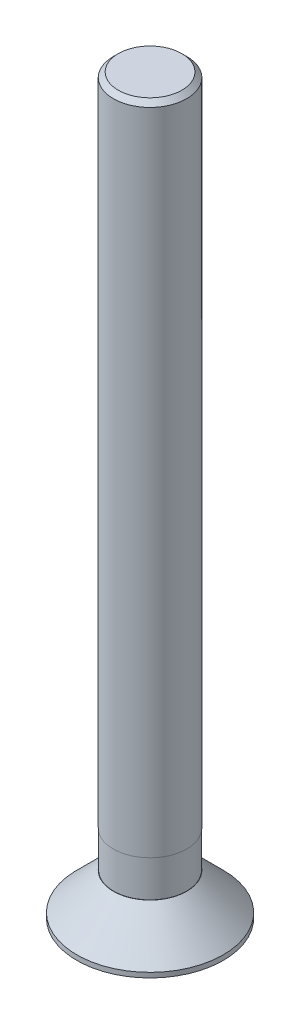
ISO-10303-21;
HEADER;
FILE_DESCRIPTION(('STEP AP214'),'2;1');
FILE_NAME('part.step','',(''),(''),'','','');
FILE_SCHEMA(('AUTOMOTIVE_DESIGN { 1 0 10303 214 1 1 1 1 }'));
ENDSEC;
DATA;
#1=APPLICATION_CONTEXT('core data for automotive mechanical design processes');
#2=APPLICATION_PROTOCOL_DEFINITION('international standard','automotive_design',2000,#1);
#3=PRODUCT_CONTEXT('',#1,'mechanical');
#4=PRODUCT('Part','Part','',(#3));
#5=PRODUCT_RELATED_PRODUCT_CATEGORY('part','',(#4));
#6=PRODUCT_DEFINITION_FORMATION('','',#4);
#7=PRODUCT_DEFINITION_CONTEXT('part definition',#1,'design');
#8=PRODUCT_DEFINITION('design','',#6,#7);
#9=PRODUCT_DEFINITION_SHAPE('','',#8);
#10=(LENGTH_UNIT() NAMED_UNIT(*) SI_UNIT(.MILLI.,.METRE.));
#11=(NAMED_UNIT(*) PLANE_ANGLE_UNIT() SI_UNIT($,.RADIAN.));
#12=(NAMED_UNIT(*) SI_UNIT($,.STERADIAN.) SOLID_ANGLE_UNIT());
#13=UNCERTAINTY_MEASURE_WITH_UNIT(LENGTH_MEASURE(1.E-05),#10,'distance_accuracy_value','');
#14=(GEOMETRIC_REPRESENTATION_CONTEXT(3) GLOBAL_UNCERTAINTY_ASSIGNED_CONTEXT((#13)) GLOBAL_UNIT_ASSIGNED_CONTEXT((#10,
#11,#12)) REPRESENTATION_CONTEXT('',''));
#15=CARTESIAN_POINT('',(0.,0.,0.));
#16=DIRECTION('',(0.,0.,1.));
#17=DIRECTION('',(1.,0.,0.));
#18=AXIS2_PLACEMENT_3D('',#15,#16,#17);
#19=CARTESIAN_POINT('',(0.,-1.87388386780294,0.));
#20=DIRECTION('',(0.,1.,0.));
#21=DIRECTION('',(0.,0.,1.));
#22=AXIS2_PLACEMENT_3D('',#19,#20,#21);
#23=PLANE('',#22);
#24=CARTESIAN_POINT('',(0.,-1.87388386780294,0.));
#25=DIRECTION('',(0.,-1.,0.));
#26=DIRECTION('',(0.,0.,-1.));
#27=AXIS2_PLACEMENT_3D('',#24,#25,#26);
#28=CIRCLE('',#27,1.15470053837925);
#29=CARTESIAN_POINT('',(0.577350269189622,-1.87388386780294,1.));
#30=VERTEX_POINT('',#29);
#31=CARTESIAN_POINT('',(-0.577351404949256,-1.87388386780294,1.00000196587773));
#32=VERTEX_POINT('',#31);
#33=EDGE_CURVE('E169',#30,#32,#28,.T.);
#34=ORIENTED_EDGE('',*,*,#33,.F.);
#35=CARTESIAN_POINT('',(1.15470053837925,-1.87388386780294,0.));
#36=VERTEX_POINT('',#35);
#37=EDGE_CURVE('E48',#36,#30,#28,.T.);
#38=ORIENTED_EDGE('',*,*,#37,.F.);
#39=CARTESIAN_POINT('',(0.577351404949261,-1.87388386780294,-1.00000196587773));
#40=VERTEX_POINT('',#39);
#41=EDGE_CURVE('E165',#40,#36,#28,.T.);
#42=ORIENTED_EDGE('',*,*,#41,.F.);
#43=CARTESIAN_POINT('',(-0.577349400992379,-1.87388386780294,-0.999998495164493));
#44=VERTEX_POINT('',#43);
#45=EDGE_CURVE('E63',#44,#40,#28,.T.);
#46=ORIENTED_EDGE('',*,*,#45,.F.);
#47=CARTESIAN_POINT('',(-1.15470053837925,-1.87388386780294,0.));
#48=VERTEX_POINT('',#47);
#49=EDGE_CURVE('E72',#48,#44,#28,.T.);
#50=ORIENTED_EDGE('',*,*,#49,.F.);
#51=EDGE_CURVE('E252',#32,#48,#28,.T.);
#52=ORIENTED_EDGE('',*,*,#51,.F.);
#53=EDGE_LOOP('',(#34,#38,#42,#46,#50,#52));
#54=FACE_BOUND('',#53,.T.);
#55=CARTESIAN_POINT('',(0.,-1.87388386780294,0.));
#56=DIRECTION('',(0.,-1.,0.));
#57=DIRECTION('',(0.,0.,-1.));
#58=AXIS2_PLACEMENT_3D('',#55,#56,#57);
#59=CIRCLE('',#58,3.);
#60=CARTESIAN_POINT('',(0.,-1.87388386780294,-3.));
#61=VERTEX_POINT('',#60);
#62=EDGE_CURVE('E488',#61,#61,#59,.T.);
#63=ORIENTED_EDGE('',*,*,#62,.T.);
#64=EDGE_LOOP('',(#63));
#65=FACE_BOUND('',#64,.T.);
#66=ADVANCED_FACE('F43',(#54,#65),#23,.F.);
#67=CARTESIAN_POINT('',(0.,0.,0.));
#68=DIRECTION('',(0.,-1.,0.));
#69=DIRECTION('',(0.,0.,-1.));
#70=AXIS2_PLACEMENT_3D('',#67,#68,#69);
#71=CYLINDRICAL_SURFACE('',#70,3.);
#72=ORIENTED_EDGE('',*,*,#62,.F.);
#73=EDGE_LOOP('',(#72));
#74=FACE_BOUND('',#73,.T.);
#75=CARTESIAN_POINT('',(0.,-1.67388386780294,0.));
#76=DIRECTION('',(0.,-1.,0.));
#77=DIRECTION('',(0.,0.,-1.));
#78=AXIS2_PLACEMENT_3D('',#75,#76,#77);
#79=CIRCLE('',#78,3.);
#80=CARTESIAN_POINT('',(0.,-1.67388386780294,-3.));
#81=VERTEX_POINT('',#80);
#82=EDGE_CURVE('E484',#81,#81,#79,.T.);
#83=ORIENTED_EDGE('',*,*,#82,.T.);
#84=EDGE_LOOP('',(#83));
#85=FACE_BOUND('',#84,.T.);
#86=ADVANCED_FACE('F190',(#74,#85),#71,.T.);
#87=CARTESIAN_POINT('',(0.,-0.173883867802944,0.));
#88=DIRECTION('',(0.,-1.,0.));
#89=DIRECTION('',(0.,0.,-1.));
#90=AXIS2_PLACEMENT_3D('',#87,#88,#89);
#91=CONICAL_SURFACE('',#90,1.5,0.785398163397447);
#92=ORIENTED_EDGE('',*,*,#82,.F.);
#93=EDGE_LOOP('',(#92));
#94=FACE_BOUND('',#93,.T.);
#95=CARTESIAN_POINT('',(0.,-0.173883867802944,0.));
#96=DIRECTION('',(0.,-1.,0.));
#97=DIRECTION('',(0.,0.,-1.));
#98=AXIS2_PLACEMENT_3D('',#95,#96,#97);
#99=CIRCLE('',#98,1.5);
#100=CARTESIAN_POINT('',(0.,-0.173883867802944,-1.5));
#101=VERTEX_POINT('',#100);
#102=EDGE_CURVE('E480',#101,#101,#99,.T.);
#103=ORIENTED_EDGE('',*,*,#102,.T.);
#104=EDGE_LOOP('',(#103));
#105=FACE_BOUND('',#104,.T.);
#106=ADVANCED_FACE('F527',(#94,#105),#91,.T.);
#107=CARTESIAN_POINT('',(-1.5,-0.173883867802944,0.));
#108=DIRECTION('',(0.,-1.,0.));
#109=DIRECTION('',(0.,0.,-1.));
#110=AXIS2_PLACEMENT_3D('',#107,#108,#109);
#111=PLANE('',#110);
#112=ORIENTED_EDGE('',*,*,#102,.F.);
#113=EDGE_LOOP('',(#112));
#114=FACE_BOUND('',#113,.T.);
#115=CARTESIAN_POINT('',(0.,-0.173883867802944,0.));
#116=DIRECTION('',(0.,-1.,0.));
#117=DIRECTION('',(0.,0.,-1.));
#118=AXIS2_PLACEMENT_3D('',#115,#116,#117);
#119=CIRCLE('',#118,1.49000000000001);
#120=CARTESIAN_POINT('',(0.,-0.173883867802944,-1.49000000000001));
#121=VERTEX_POINT('',#120);
#122=EDGE_CURVE('E476',#121,#121,#119,.T.);
#123=ORIENTED_EDGE('',*,*,#122,.T.);
#124=EDGE_LOOP('',(#123));
#125=FACE_BOUND('',#124,.T.);
#126=ADVANCED_FACE('F520',(#114,#125),#111,.F.);
#127=CARTESIAN_POINT('',(0.,0.,0.));
#128=DIRECTION('',(0.,-1.,0.));
#129=DIRECTION('',(0.,0.,-1.));
#130=AXIS2_PLACEMENT_3D('',#127,#128,#129);
#131=CYLINDRICAL_SURFACE('',#130,1.49000000000001);
#132=ORIENTED_EDGE('',*,*,#122,.F.);
#133=EDGE_LOOP('',(#132));
#134=FACE_BOUND('',#133,.T.);
#135=CARTESIAN_POINT('',(0.,1.32611613219706,0.));
#136=DIRECTION('',(0.,-1.,0.));
#137=DIRECTION('',(0.,0.,-1.));
#138=AXIS2_PLACEMENT_3D('',#135,#136,#137);
#139=CIRCLE('',#138,1.49000000000001);
#140=CARTESIAN_POINT('',(0.,1.32611613219706,-1.49000000000001));
#141=VERTEX_POINT('',#140);
#142=EDGE_CURVE('E235',#141,#141,#139,.T.);
#143=ORIENTED_EDGE('',*,*,#142,.T.);
#144=EDGE_LOOP('',(#143));
#145=FACE_BOUND('',#144,.T.);
#146=ADVANCED_FACE('F514',(#134,#145),#131,.T.);
#147=CARTESIAN_POINT('',(-1.5,1.32611613219706,0.));
#148=DIRECTION('',(0.,1.,0.));
#149=DIRECTION('',(0.,0.,1.));
#150=AXIS2_PLACEMENT_3D('',#147,#148,#149);
#151=PLANE('',#150);
#152=ORIENTED_EDGE('',*,*,#142,.F.);
#153=EDGE_LOOP('',(#152));
#154=FACE_BOUND('',#153,.T.);
#155=CARTESIAN_POINT('',(0.,1.32611613219706,0.));
#156=DIRECTION('',(0.,-1.,0.));
#157=DIRECTION('',(0.,0.,-1.));
#158=AXIS2_PLACEMENT_3D('',#155,#156,#157);
#159=CIRCLE('',#158,1.5);
#160=CARTESIAN_POINT('',(0.,1.32611613219706,-1.5));
#161=VERTEX_POINT('',#160);
#162=EDGE_CURVE('E229',#161,#161,#159,.T.);
#163=ORIENTED_EDGE('',*,*,#162,.T.);
#164=EDGE_LOOP('',(#163));
#165=FACE_BOUND('',#164,.T.);
#166=ADVANCED_FACE('F509',(#154,#165),#151,.F.);
#167=CARTESIAN_POINT('',(0.,0.,0.));
#168=DIRECTION('',(0.,-1.,0.));
#169=DIRECTION('',(0.,0.,-1.));
#170=AXIS2_PLACEMENT_3D('',#167,#168,#169);
#171=CYLINDRICAL_SURFACE('',#170,1.5);
#172=CARTESIAN_POINT('',(0.,27.9261161321971,0.));
#173=DIRECTION('',(0.,-1.,0.));
#174=DIRECTION('',(0.,0.,-1.));
#175=AXIS2_PLACEMENT_3D('',#172,#173,#174);
#176=CIRCLE('',#175,1.5);
#177=CARTESIAN_POINT('',(0.,27.9261161321971,-1.5));
#178=VERTEX_POINT('',#177);
#179=EDGE_CURVE('E492',#178,#178,#176,.T.);
#180=ORIENTED_EDGE('',*,*,#179,.T.);
#181=EDGE_LOOP('',(#180));
#182=FACE_BOUND('',#181,.T.);
#183=ORIENTED_EDGE('',*,*,#162,.F.);
#184=EDGE_LOOP('',(#183));
#185=FACE_BOUND('',#184,.T.);
#186=ADVANCED_FACE('F506',(#182,#185),#171,.T.);
#187=CARTESIAN_POINT('',(-1.5,28.1261161321971,0.));
#188=DIRECTION('',(0.,-1.,0.));
#189=DIRECTION('',(0.,0.,-1.));
#190=AXIS2_PLACEMENT_3D('',#187,#188,#189);
#191=PLANE('',#190);
#192=CARTESIAN_POINT('',(0.,28.1261161321971,0.));
#193=DIRECTION('',(0.,-1.,0.));
#194=DIRECTION('',(0.,0.,-1.));
#195=AXIS2_PLACEMENT_3D('',#192,#193,#194);
#196=CIRCLE('',#195,1.3);
#197=CARTESIAN_POINT('',(0.,28.1261161321971,-1.3));
#198=VERTEX_POINT('',#197);
#199=EDGE_CURVE('E143',#198,#198,#196,.F.);
#200=ORIENTED_EDGE('',*,*,#199,.T.);
#201=EDGE_LOOP('',(#200));
#202=FACE_BOUND('',#201,.T.);
#203=ADVANCED_FACE('F500',(#202),#191,.F.);
#204=CARTESIAN_POINT('',(0.,27.9261161321971,0.));
#205=DIRECTION('',(0.,-1.,0.));
#206=DIRECTION('',(0.,0.,-1.));
#207=AXIS2_PLACEMENT_3D('',#204,#205,#206);
#208=CONICAL_SURFACE('',#207,1.5,0.785398163397445);
#209=ORIENTED_EDGE('',*,*,#199,.F.);
#210=EDGE_LOOP('',(#209));
#211=FACE_BOUND('',#210,.T.);
#212=ORIENTED_EDGE('',*,*,#179,.F.);
#213=EDGE_LOOP('',(#212));
#214=FACE_BOUND('',#213,.T.);
#215=ADVANCED_FACE('F46',(#211,#214),#208,.T.);
#216=CARTESIAN_POINT('',(0.,-1.67388386780294,0.));
#217=DIRECTION('',(0.,-1.,0.));
#218=DIRECTION('',(0.,0.,-1.));
#219=AXIS2_PLACEMENT_3D('',#216,#217,#218);
#220=CONICAL_SURFACE('',#219,1.,0.658373937780637);
#221=ORIENTED_EDGE('',*,*,#37,.T.);
#222=CARTESIAN_POINT('',(1.15481600843309,-1.87403317222531,-0.000200000000004098));
#223=CARTESIAN_POINT('',(1.12316968084601,-1.83312074343118,0.0546130472537906));
#224=CARTESIAN_POINT('',(1.08981777101109,-1.7949634354735,0.112380249617313));
#225=CARTESIAN_POINT('',(1.01992640588559,-1.73108200853424,0.23343564502504));
#226=CARTESIAN_POINT('',(0.983356831795588,-1.70549438660236,0.296776005360072));
#227=CARTESIAN_POINT('',(0.922834286723981,-1.68090454364989,0.401604128427474));
#228=CARTESIAN_POINT('',(0.899599220479203,-1.67539508616111,0.441848443680657));
#229=CARTESIAN_POINT('',(0.853188056508933,-1.67292846256111,0.522234937715575));
#230=CARTESIAN_POINT('',(0.830012776254828,-1.67590886460221,0.562375700595333));
#231=CARTESIAN_POINT('',(0.7843927818388,-1.68969055585273,0.641391848764902));
#232=CARTESIAN_POINT('',(0.761945122594874,-1.70045466265438,0.680272335086375));
#233=CARTESIAN_POINT('',(0.717921697470909,-1.72826497434569,0.756523144124287));
#234=CARTESIAN_POINT('',(0.696352541805856,-1.74535152902818,0.793882017612521));
#235=CARTESIAN_POINT('',(0.658212463672071,-1.78048875912147,0.859942570744883));
#236=CARTESIAN_POINT('',(0.641457966963329,-1.79776924631449,0.888962210299669));
#237=CARTESIAN_POINT('',(0.608790299876737,-1.83445807832726,0.945544269458392));
#238=CARTESIAN_POINT('',(0.592869676372208,-1.85383970255314,0.973119598256412));
#239=CARTESIAN_POINT('',(0.577234799135784,-1.87403317222531,1.0002));
#240=B_SPLINE_CURVE_WITH_KNOTS('',3,(#222,#223,#224,#225,#226,#227,#228,#229,#230,#231,#232,
#233,#234,#235,#236,#237,#238,#239),.UNSPECIFIED.,.F.,.F.,(4,2,2,2,2,2,2,2,4),(0.,
0.22823977330086,0.458906090274109,0.598520267097166,0.737110419889317,0.875042870692217,
1.01387122981251,1.12688253422818,1.23859578016276),.UNSPECIFIED.);
#241=CARTESIAN_POINT('',(0.865926084268559,-1.67388389330864,0.50017202644768));
#242=VERTEX_POINT('',#241);
#243=EDGE_CURVE('E55',#242,#30,#240,.T.);
#244=ORIENTED_EDGE('',*,*,#243,.F.);
#245=CARTESIAN_POINT('',(0.866025403784436,-1.67388386780294,0.499999999999998));
#246=DIRECTION('',(-0.499999995877937,-0.000128402284208529,0.866025396645455));
#247=VECTOR('',#246,1.);
#248=LINE('',#245,#247);
#249=CARTESIAN_POINT('',(0.866023851838297,-1.67388386780294,0.499999104796667));
#250=VERTEX_POINT('',#249);
#251=EDGE_CURVE('E134',#250,#242,#248,.T.);
#252=ORIENTED_EDGE('',*,*,#251,.F.);
#253=EDGE_CURVE('E12',#36,#250,#240,.T.);
#254=ORIENTED_EDGE('',*,*,#253,.F.);
#255=EDGE_LOOP('',(#221,#244,#252,#254));
#256=FACE_BOUND('',#255,.T.);
#257=ADVANCED_FACE('F137',(#256),#220,.F.);
#258=CARTESIAN_POINT('',(1.74946039515207,-2.98622053745507,1.));
#259=CARTESIAN_POINT('',(1.71490598097623,-2.94743978576866,1.));
#260=CARTESIAN_POINT('',(1.68021399021888,-2.90878115811559,1.));
#261=CARTESIAN_POINT('',(1.61049820974119,-2.83175960602862,1.));
#262=CARTESIAN_POINT('',(1.57547439758845,-2.79339670190933,1.));
#263=CARTESIAN_POINT('',(1.46967789807064,-2.6786746318803,1.));
#264=CARTESIAN_POINT('',(1.39832631988853,-2.60284714209043,1.));
#265=CARTESIAN_POINT('',(1.25293800412587,-2.45276760921713,1.));
#266=CARTESIAN_POINT('',(1.17888614666626,-2.37853003041564,1.));
#267=CARTESIAN_POINT('',(1.06535145591423,-2.26979317138239,1.));
#268=CARTESIAN_POINT('',(1.02711265051045,-2.23399774768984,1.));
#269=CARTESIAN_POINT('',(0.949599007497123,-2.16355042984483,1.));
#270=CARTESIAN_POINT('',(0.910324307618786,-2.12889838503555,1.));
#271=CARTESIAN_POINT('',(0.842934248717363,-2.07169975206539,1.));
#272=CARTESIAN_POINT('',(0.815162250705751,-2.04875079848051,1.));
#273=CARTESIAN_POINT('',(0.758894164969058,-2.00376366855252,1.));
#274=CARTESIAN_POINT('',(0.730398036148671,-1.98172554408731,1.));
#275=CARTESIAN_POINT('',(0.643415978235554,-1.91712929875804,1.));
#276=CARTESIAN_POINT('',(0.583620551399759,-1.87624984500157,1.));
#277=CARTESIAN_POINT('',(0.489902556493574,-1.82023879260686,1.));
#278=CARTESIAN_POINT('',(0.457659968959687,-1.80230625143591,1.));
#279=CARTESIAN_POINT('',(0.391834100041796,-1.76903347978998,1.));
#280=CARTESIAN_POINT('',(0.358250545139573,-1.75369378155296,1.));
#281=CARTESIAN_POINT('',(0.289966565744284,-1.72648936471326,1.));
#282=CARTESIAN_POINT('',(0.255276316057332,-1.71459962866651,1.));
#283=CARTESIAN_POINT('',(0.18475409362299,-1.69500971677905,1.));
#284=CARTESIAN_POINT('',(0.148923497812488,-1.68730467709885,1.));
#285=CARTESIAN_POINT('',(0.0667196245725714,-1.67542128149863,1.));
#286=CARTESIAN_POINT('',(0.0201105441514157,-1.67275566650587,1.));
#287=CARTESIAN_POINT('',(-0.0728176433267195,-1.67590978598559,1.));
#288=CARTESIAN_POINT('',(-0.119136547605071,-1.68173490612168,1.));
#289=CARTESIAN_POINT('',(-0.222943513549701,-1.7035295534711,1.));
#290=CARTESIAN_POINT('',(-0.279918110274245,-1.72188720693132,1.));
#291=CARTESIAN_POINT('',(-0.362675523736122,-1.75585973378705,1.));
#292=CARTESIAN_POINT('',(-0.389877126336371,-1.76829699441004,1.));
#293=CARTESIAN_POINT('',(-0.443413083618481,-1.79491935238221,1.));
#294=CARTESIAN_POINT('',(-0.46974759758685,-1.80910412641262,1.));
#295=CARTESIAN_POINT('',(-0.534014683597469,-1.84599900448052,1.));
#296=CARTESIAN_POINT('',(-0.571466063059361,-1.86954023573211,1.));
#297=CARTESIAN_POINT('',(-0.644875712231838,-1.91886006629021,1.));
#298=CARTESIAN_POINT('',(-0.680833047866887,-1.94464003503864,1.));
#299=CARTESIAN_POINT('',(-0.786997660027537,-2.02453242756599,1.));
#300=CARTESIAN_POINT('',(-0.855344819680259,-2.08110309651398,1.));
#301=CARTESIAN_POINT('',(-0.989044454048233,-2.19829654430549,1.));
#302=CARTESIAN_POINT('',(-1.05437833072248,-2.25893995318044,1.));
#303=CARTESIAN_POINT('',(-1.18273377027038,-2.38265433977611,1.));
#304=CARTESIAN_POINT('',(-1.24575458792862,-2.44572608667292,1.));
#305=CARTESIAN_POINT('',(-1.38397613565864,-2.5876829643873,1.));
#306=CARTESIAN_POINT('',(-1.45876723860354,-2.66696433346289,1.));
#307=CARTESIAN_POINT('',(-1.56921270109722,-2.78655636427148,1.));
#308=CARTESIAN_POINT('',(-1.60551164033561,-2.8262767110034,1.));
#309=CARTESIAN_POINT('',(-1.6777430281649,-2.90602765426627,1.));
#310=CARTESIAN_POINT('',(-1.71367558378656,-2.94605815380769,1.));
#311=CARTESIAN_POINT('',(-1.74946039515208,-2.98622053745508,1.));
#312=B_SPLINE_CURVE_WITH_KNOTS('',3,(#258,#259,#260,#261,#262,#263,#264,#265,#266,#267,#268,
#269,#270,#271,#272,#273,#274,#275,#276,#277,#278,#279,#280,#281,#282,#283,#284,#285,#286,#287,
#288,#289,#290,#291,#292,#293,#294,#295,#296,#297,#298,#299,#300,#301,#302,#303,#304,#305,#306,
#307,#308,#309,#310,#311),.UNSPECIFIED.,.F.,.F.,(4,2,2,2,2,2,2,2,2,2,2,2,2,2,2,2,2,2,2,2,2,2,2,
2,2,2,4),(0.,0.155825516746859,0.311661644151836,0.623995166220761,0.938481829948363,
1.09560119142975,1.25269976679341,1.36076101105599,1.46882840168225,1.68569503990805,
1.79629172867447,1.9069110923428,2.01670701512948,2.12637504838361,2.26563688420522,
2.40498709209947,2.58344412422902,2.67313589249939,2.7628110911662,2.89540413569459,
3.02807886690881,3.2939642294632,3.56131620225153,3.82875356694802,4.15569124876772,
4.31711445070644,4.47848906154051),.UNSPECIFIED.);
#313=EDGE_CURVE('E277',#30,#32,#312,.T.);
#314=ORIENTED_EDGE('',*,*,#313,.F.);
#315=ORIENTED_EDGE('',*,*,#33,.T.);
#316=EDGE_LOOP('',(#314,#315));
#317=FACE_BOUND('',#316,.T.);
#318=ADVANCED_FACE('F276',(#317),#220,.F.);
#319=CARTESIAN_POINT('',(0.,-1.67388386780294,0.));
#320=DIRECTION('',(0.,1.,0.));
#321=DIRECTION('',(0.,0.,1.));
#322=AXIS2_PLACEMENT_3D('',#319,#320,#321);
#323=CIRCLE('',#322,1.);
#324=CARTESIAN_POINT('',(-0.866111623060335,-1.67388386780294,0.4998550957661));
#325=VERTEX_POINT('',#324);
#326=CARTESIAN_POINT('',(-0.866027322416126,-1.67388386780294,0.500001108595568));
#327=VERTEX_POINT('',#326);
#328=EDGE_CURVE('E284',#325,#327,#323,.T.);
#329=ORIENTED_EDGE('',*,*,#328,.T.);
#330=CARTESIAN_POINT('',(-0.577234799135788,-1.87403317222531,1.0002));
#331=CARTESIAN_POINT('',(-0.60888112672287,-1.83312074343118,0.945386952746207));
#332=CARTESIAN_POINT('',(-0.642233036557782,-1.7949634354735,0.887619750382685));
#333=CARTESIAN_POINT('',(-0.712124401683289,-1.73108200853424,0.766564354974958));
#334=CARTESIAN_POINT('',(-0.748693975773288,-1.70549438660236,0.703223994639925));
#335=CARTESIAN_POINT('',(-0.809216520844896,-1.68090454364989,0.598395871572523));
#336=CARTESIAN_POINT('',(-0.832451587089673,-1.67539508616111,0.55815155631934));
#337=CARTESIAN_POINT('',(-0.878862751059943,-1.67292846256111,0.477765062284422));
#338=CARTESIAN_POINT('',(-0.902038031314049,-1.67590886460222,0.437624299404664));
#339=CARTESIAN_POINT('',(-0.947658025730077,-1.68969055585273,0.358608151235094));
#340=CARTESIAN_POINT('',(-0.970105684974003,-1.70045466265438,0.319727664913622));
#341=CARTESIAN_POINT('',(-1.01412911009797,-1.7282649743457,0.243476855875709));
#342=CARTESIAN_POINT('',(-1.03569826576302,-1.74535152902818,0.206117982387474));
#343=CARTESIAN_POINT('',(-1.07383834389681,-1.78048875912148,0.140057429255114));
#344=CARTESIAN_POINT('',(-1.09059284060555,-1.79776924631449,0.111037789700329));
#345=CARTESIAN_POINT('',(-1.12326050769214,-1.83445807832727,0.0544557305416077));
#346=CARTESIAN_POINT('',(-1.13918113119667,-1.85383970255314,0.026880401743589));
#347=CARTESIAN_POINT('',(-1.15481600843309,-1.87403317222531,-0.000199999999999622));
#348=B_SPLINE_CURVE_WITH_KNOTS('',3,(#330,#331,#332,#333,#334,#335,#336,#337,#338,#339,#340,
#341,#342,#343,#344,#345,#346,#347),.UNSPECIFIED.,.F.,.F.,(4,2,2,2,2,2,2,2,4),(0.,
0.22823977330086,0.458906090274109,0.598520267097166,0.737110419889318,0.875042870692218,
1.01387122981251,1.12688253422818,1.23859578016276),.UNSPECIFIED.);
#349=EDGE_CURVE('E280',#32,#327,#348,.T.);
#350=ORIENTED_EDGE('',*,*,#349,.F.);
#351=ORIENTED_EDGE('',*,*,#51,.T.);
#352=EDGE_CURVE('E437',#325,#48,#348,.T.);
#353=ORIENTED_EDGE('',*,*,#352,.F.);
#354=EDGE_LOOP('',(#329,#350,#351,#353));
#355=FACE_BOUND('',#354,.T.);
#356=ADVANCED_FACE('F282',(#355),#220,.F.);
#357=CARTESIAN_POINT('',(-0.865924532410195,-1.67388386780294,-0.500171130883746));
#358=VERTEX_POINT('',#357);
#359=CARTESIAN_POINT('',(-0.866023851838296,-1.67388386780294,-0.499999104796667));
#360=VERTEX_POINT('',#359);
#361=EDGE_CURVE('E423',#358,#360,#323,.T.);
#362=ORIENTED_EDGE('',*,*,#361,.T.);
#363=CARTESIAN_POINT('',(-1.15481600843309,-1.87403317222531,0.000200000000000224));
#364=CARTESIAN_POINT('',(-1.12316968084601,-1.83312074343118,-0.0546130472537944));
#365=CARTESIAN_POINT('',(-1.0898177710111,-1.7949634354735,-0.112380249617317));
#366=CARTESIAN_POINT('',(-1.01992640588559,-1.73108200853424,-0.233435645025043));
#367=CARTESIAN_POINT('',(-0.98335683179559,-1.70549438660236,-0.296776005360076));
#368=CARTESIAN_POINT('',(-0.922834286723983,-1.68090454364989,-0.401604128427477));
#369=CARTESIAN_POINT('',(-0.899599220479205,-1.67539508616111,-0.441848443680661));
#370=CARTESIAN_POINT('',(-0.853188056508935,-1.67292846256111,-0.522234937715578));
#371=CARTESIAN_POINT('',(-0.83001277625483,-1.67590886460222,-0.562375700595336));
#372=CARTESIAN_POINT('',(-0.784392781838801,-1.68969055585273,-0.641391848764907));
#373=CARTESIAN_POINT('',(-0.761945122594876,-1.70045466265438,-0.680272335086379));
#374=CARTESIAN_POINT('',(-0.71792169747091,-1.7282649743457,-0.756523144124291));
#375=CARTESIAN_POINT('',(-0.696352541805856,-1.74535152902818,-0.793882017612526));
#376=CARTESIAN_POINT('',(-0.658212463672073,-1.78048875912148,-0.859942570744886));
#377=CARTESIAN_POINT('',(-0.641457966963332,-1.79776924631449,-0.888962210299671));
#378=CARTESIAN_POINT('',(-0.608790299876741,-1.83445807832727,-0.945544269458392));
#379=CARTESIAN_POINT('',(-0.592869676372212,-1.85383970255314,-0.973119598256411));
#380=CARTESIAN_POINT('',(-0.577234799135788,-1.87403317222531,-1.0002));
#381=B_SPLINE_CURVE_WITH_KNOTS('',3,(#363,#364,#365,#366,#367,#368,#369,#370,#371,#372,#373,
#374,#375,#376,#377,#378,#379,#380),.UNSPECIFIED.,.F.,.F.,(4,2,2,2,2,2,2,2,4),(0.,
0.228239773300859,0.458906090274109,0.598520267097166,0.737110419889317,0.875042870692218,
1.01387122981251,1.12688253422817,1.23859578016276),.UNSPECIFIED.);
#382=EDGE_CURVE('E426',#48,#360,#381,.T.);
#383=ORIENTED_EDGE('',*,*,#382,.F.);
#384=ORIENTED_EDGE('',*,*,#49,.T.);
#385=EDGE_CURVE('E429',#358,#44,#381,.T.);
#386=ORIENTED_EDGE('',*,*,#385,.F.);
#387=EDGE_LOOP('',(#362,#383,#384,#386));
#388=FACE_BOUND('',#387,.T.);
#389=ADVANCED_FACE('F425',(#388),#220,.F.);
#390=CARTESIAN_POINT('',(0.,-1.67388386780294,-1.));
#391=VERTEX_POINT('',#390);
#392=CARTESIAN_POINT('',(-0.000533167265095548,-1.67388386780294,-1.0000000022393));
#393=VERTEX_POINT('',#392);
#394=EDGE_CURVE('E254',#391,#393,#323,.T.);
#395=ORIENTED_EDGE('',*,*,#394,.T.);
#396=CARTESIAN_POINT('',(-1.74946039515208,-2.98622053745508,-1.));
#397=CARTESIAN_POINT('',(-1.71490598097624,-2.94743978576867,-1.));
#398=CARTESIAN_POINT('',(-1.68021399021889,-2.9087811581156,-1.));
#399=CARTESIAN_POINT('',(-1.6104982097412,-2.83175960602863,-1.));
#400=CARTESIAN_POINT('',(-1.57547439758846,-2.79339670190934,-1.));
#401=CARTESIAN_POINT('',(-1.46967789807065,-2.6786746318803,-1.));
#402=CARTESIAN_POINT('',(-1.39832631988854,-2.60284714209044,-1.));
#403=CARTESIAN_POINT('',(-1.25293800412588,-2.45276760921714,-1.));
#404=CARTESIAN_POINT('',(-1.17888614666626,-2.37853003041565,-1.));
#405=CARTESIAN_POINT('',(-1.06535145591424,-2.2697931713824,-1.));
#406=CARTESIAN_POINT('',(-1.02711265051046,-2.23399774768985,-0.999999999999999));
#407=CARTESIAN_POINT('',(-0.949599007497132,-2.16355042984484,-0.999999999999999));
#408=CARTESIAN_POINT('',(-0.910324307618795,-2.12889838503555,-0.999999999999999));
#409=CARTESIAN_POINT('',(-0.842934248717371,-2.07169975206539,-0.999999999999999));
#410=CARTESIAN_POINT('',(-0.81516225070576,-2.04875079848051,-0.999999999999999));
#411=CARTESIAN_POINT('',(-0.758894164969067,-2.00376366855252,-0.999999999999999));
#412=CARTESIAN_POINT('',(-0.73039803614868,-1.98172554408731,-0.999999999999999));
#413=CARTESIAN_POINT('',(-0.643415978235562,-1.91712929875804,-0.999999999999999));
#414=CARTESIAN_POINT('',(-0.583620551399768,-1.87624984500158,-0.999999999999999));
#415=CARTESIAN_POINT('',(-0.489902556493582,-1.82023879260686,-0.999999999999999));
#416=CARTESIAN_POINT('',(-0.457659968959695,-1.80230625143592,-0.999999999999999));
#417=CARTESIAN_POINT('',(-0.391834100041804,-1.76903347978998,-0.999999999999999));
#418=CARTESIAN_POINT('',(-0.358250545139581,-1.75369378155296,-0.999999999999999));
#419=CARTESIAN_POINT('',(-0.289966565744292,-1.72648936471326,-0.999999999999999));
#420=CARTESIAN_POINT('',(-0.25527631605734,-1.71459962866651,-0.999999999999999));
#421=CARTESIAN_POINT('',(-0.184754093622998,-1.69500971677905,-0.999999999999999));
#422=CARTESIAN_POINT('',(-0.148923497812496,-1.68730467709885,-0.999999999999999));
#423=CARTESIAN_POINT('',(-0.0667196245725796,-1.67542128149862,-0.999999999999999));
#424=CARTESIAN_POINT('',(-0.0201105441514239,-1.67275566650587,-0.999999999999999));
#425=CARTESIAN_POINT('',(0.0728176433267109,-1.67590978598558,-0.999999999999999));
#426=CARTESIAN_POINT('',(0.119136547605062,-1.68173490612168,-0.999999999999999));
#427=CARTESIAN_POINT('',(0.222943513549691,-1.70352955347109,-0.999999999999999));
#428=CARTESIAN_POINT('',(0.279918110274234,-1.72188720693132,-0.999999999999999));
#429=CARTESIAN_POINT('',(0.36267552373611,-1.75585973378704,-0.999999999999999));
#430=CARTESIAN_POINT('',(0.389877126336358,-1.76829699441003,-0.999999999999999));
#431=CARTESIAN_POINT('',(0.443413083618467,-1.7949193523822,-0.999999999999999));
#432=CARTESIAN_POINT('',(0.469747597586836,-1.8091041264126,-0.999999999999998));
#433=CARTESIAN_POINT('',(0.534014683597453,-1.8459990044805,-0.999999999999998));
#434=CARTESIAN_POINT('',(0.571466063059343,-1.8695402357321,-0.999999999999998));
#435=CARTESIAN_POINT('',(0.644875712231818,-1.91886006629019,-0.999999999999998));
#436=CARTESIAN_POINT('',(0.680833047866865,-1.94464003503862,-0.999999999999998));
#437=CARTESIAN_POINT('',(0.786997660027511,-2.02453242756597,-0.999999999999998));
#438=CARTESIAN_POINT('',(0.855344819680232,-2.08110309651396,-0.999999999999998));
#439=CARTESIAN_POINT('',(0.989044454048202,-2.19829654430546,-0.999999999999998));
#440=CARTESIAN_POINT('',(1.05437833072245,-2.2589399531804,-0.999999999999998));
#441=CARTESIAN_POINT('',(1.18273377027034,-2.38265433977607,-0.999999999999998));
#442=CARTESIAN_POINT('',(1.24575458792858,-2.44572608667288,-0.999999999999998));
#443=CARTESIAN_POINT('',(1.3839761356586,-2.58768296438726,-0.999999999999998));
#444=CARTESIAN_POINT('',(1.45876723860351,-2.66696433346286,-0.999999999999998));
#445=CARTESIAN_POINT('',(1.5692127010972,-2.78655636427147,-0.999999999999998));
#446=CARTESIAN_POINT('',(1.6055116403356,-2.82627671100339,-0.999999999999997));
#447=CARTESIAN_POINT('',(1.6777430281649,-2.90602765426626,-0.999999999999997));
#448=CARTESIAN_POINT('',(1.71367558378656,-2.94605815380769,-0.999999999999997));
#449=CARTESIAN_POINT('',(1.74946039515208,-2.98622053745508,-0.999999999999997));
#450=B_SPLINE_CURVE_WITH_KNOTS('',3,(#396,#397,#398,#399,#400,#401,#402,#403,#404,#405,#406,
#407,#408,#409,#410,#411,#412,#413,#414,#415,#416,#417,#418,#419,#420,#421,#422,#423,#424,#425,
#426,#427,#428,#429,#430,#431,#432,#433,#434,#435,#436,#437,#438,#439,#440,#441,#442,#443,#444,
#445,#446,#447,#448,#449),.UNSPECIFIED.,.F.,.F.,(4,2,2,2,2,2,2,2,2,2,2,2,2,2,2,2,2,2,2,2,2,2,2,
2,2,2,4),(0.,0.155825516746859,0.311661644151838,0.623995166220764,0.938481829948367,
1.09560119142975,1.25269976679341,1.36076101105599,1.46882840168226,1.68569503990806,
1.79629172867448,1.90691109234281,2.01670701512949,2.12637504838362,2.26563688420523,
2.40498709209948,2.58344412422902,2.67313589249939,2.7628110911662,2.89540413569458,
3.0280788669088,3.29396422946318,3.5613162022515,3.82875356694798,4.15569124876772,
4.31711445070645,4.47848906154054),.UNSPECIFIED.);
#451=EDGE_CURVE('E440',#44,#393,#450,.T.);
#452=ORIENTED_EDGE('',*,*,#451,.F.);
#453=ORIENTED_EDGE('',*,*,#45,.T.);
#454=EDGE_CURVE('E451',#391,#40,#450,.T.);
#455=ORIENTED_EDGE('',*,*,#454,.F.);
#456=EDGE_LOOP('',(#395,#452,#453,#455));
#457=FACE_BOUND('',#456,.T.);
#458=ADVANCED_FACE('F328',(#457),#220,.F.);
#459=ORIENTED_EDGE('',*,*,#41,.T.);
#460=CARTESIAN_POINT('',(0.57723479913579,-1.87403317222531,-1.0002));
#461=CARTESIAN_POINT('',(0.608881126722872,-1.83312074343118,-0.945386952746204));
#462=CARTESIAN_POINT('',(0.642233036557783,-1.7949634354735,-0.887619750382682));
#463=CARTESIAN_POINT('',(0.71212440168329,-1.73108200853424,-0.766564354974956));
#464=CARTESIAN_POINT('',(0.748693975773288,-1.70549438660236,-0.703223994639924));
#465=CARTESIAN_POINT('',(0.809216520844896,-1.68090454364989,-0.598395871572522));
#466=CARTESIAN_POINT('',(0.832451587089673,-1.67539508616111,-0.558151556319339));
#467=CARTESIAN_POINT('',(0.878862751059943,-1.67292846256111,-0.477765062284421));
#468=CARTESIAN_POINT('',(0.902038031314048,-1.67590886460222,-0.437624299404663));
#469=CARTESIAN_POINT('',(0.947658025730077,-1.68969055585273,-0.358608151235093));
#470=CARTESIAN_POINT('',(0.970105684974003,-1.70045466265438,-0.319727664913621));
#471=CARTESIAN_POINT('',(1.01412911009797,-1.7282649743457,-0.243476855875709));
#472=CARTESIAN_POINT('',(1.03569826576302,-1.74535152902818,-0.206117982387474));
#473=CARTESIAN_POINT('',(1.0738383438968,-1.78048875912148,-0.140057429255115));
#474=CARTESIAN_POINT('',(1.09059284060555,-1.79776924631449,-0.11103778970033));
#475=CARTESIAN_POINT('',(1.12326050769214,-1.83445807832726,-0.0544557305416104));
#476=CARTESIAN_POINT('',(1.13918113119666,-1.85383970255314,-0.0268804017435923));
#477=CARTESIAN_POINT('',(1.15481600843309,-1.87403317222531,0.000199999999995791));
#478=B_SPLINE_CURVE_WITH_KNOTS('',3,(#460,#461,#462,#463,#464,#465,#466,#467,#468,#469,#470,
#471,#472,#473,#474,#475,#476,#477),.UNSPECIFIED.,.F.,.F.,(4,2,2,2,2,2,2,2,4),(0.,
0.228239773300858,0.458906090274105,0.598520267097162,0.737110419889314,0.875042870692214,
1.0138712298125,1.12688253422817,1.23859578016275),.UNSPECIFIED.);
#479=CARTESIAN_POINT('',(0.866111623060337,-1.67388386780294,-0.499855095766098));
#480=VERTEX_POINT('',#479);
#481=EDGE_CURVE('E288',#480,#36,#478,.T.);
#482=ORIENTED_EDGE('',*,*,#481,.F.);
#483=CARTESIAN_POINT('',(0.866027322416126,-1.67388386780294,-0.500001108595569));
#484=VERTEX_POINT('',#483);
#485=EDGE_CURVE('E248',#480,#484,#323,.T.);
#486=ORIENTED_EDGE('',*,*,#485,.T.);
#487=EDGE_CURVE('E445',#40,#484,#478,.T.);
#488=ORIENTED_EDGE('',*,*,#487,.F.);
#489=EDGE_LOOP('',(#459,#482,#486,#488));
#490=FACE_BOUND('',#489,.T.);
#491=ADVANCED_FACE('F323',(#490),#220,.F.);
#492=CARTESIAN_POINT('',(0.,-0.673883867802944,0.));
#493=DIRECTION('',(0.,-1.,0.));
#494=DIRECTION('',(0.,0.,-1.));
#495=AXIS2_PLACEMENT_3D('',#492,#493,#494);
#496=PLANE('',#495);
#497=DIRECTION('',(0.5,0.,0.866025403784439));
#498=VECTOR('',#497,1.);
#499=CARTESIAN_POINT('',(0.577350269189628,-0.673883867802944,-0.999999999999998));
#500=LINE('',#499,#498);
#501=CARTESIAN_POINT('',(0.577350269189628,-0.673883867802944,-0.999999999999998));
#502=VERTEX_POINT('',#501);
#503=CARTESIAN_POINT('',(1.15470053837925,-0.673883867802944,0.));
#504=VERTEX_POINT('',#503);
#505=EDGE_CURVE('E450',#502,#504,#500,.T.);
#506=ORIENTED_EDGE('',*,*,#505,.T.);
#507=DIRECTION('',(-0.5,0.,0.866025403784439));
#508=VECTOR('',#507,1.);
#509=CARTESIAN_POINT('',(1.15470053837925,-0.673883867802944,0.));
#510=LINE('',#509,#508);
#511=CARTESIAN_POINT('',(0.577350269189622,-0.673883867802944,1.));
#512=VERTEX_POINT('',#511);
#513=EDGE_CURVE('E152',#504,#512,#510,.T.);
#514=ORIENTED_EDGE('',*,*,#513,.T.);
#515=DIRECTION('',(-1.,0.,0.));
#516=VECTOR('',#515,1.);
#517=CARTESIAN_POINT('',(0.577350269189622,-0.673883867802944,1.));
#518=LINE('',#517,#516);
#519=CARTESIAN_POINT('',(-0.577350269189626,-0.673883867802944,1.));
#520=VERTEX_POINT('',#519);
#521=EDGE_CURVE('E305',#512,#520,#518,.T.);
#522=ORIENTED_EDGE('',*,*,#521,.T.);
#523=DIRECTION('',(-0.5,0.,-0.866025403784439));
#524=VECTOR('',#523,1.);
#525=CARTESIAN_POINT('',(-0.577350269189626,-0.673883867802944,1.));
#526=LINE('',#525,#524);
#527=CARTESIAN_POINT('',(-1.15470053837925,-0.673883867802944,0.));
#528=VERTEX_POINT('',#527);
#529=EDGE_CURVE('E293',#520,#528,#526,.T.);
#530=ORIENTED_EDGE('',*,*,#529,.T.);
#531=DIRECTION('',(0.500000000000001,0.,-0.866025403784438));
#532=VECTOR('',#531,1.);
#533=CARTESIAN_POINT('',(-1.15470053837925,-0.673883867802944,0.));
#534=LINE('',#533,#532);
#535=CARTESIAN_POINT('',(-0.577350269189626,-0.673883867802944,-0.999999999999999));
#536=VERTEX_POINT('',#535);
#537=EDGE_CURVE('E466',#528,#536,#534,.T.);
#538=ORIENTED_EDGE('',*,*,#537,.T.);
#539=DIRECTION('',(1.,0.,0.));
#540=VECTOR('',#539,1.);
#541=CARTESIAN_POINT('',(-0.577350269189626,-0.673883867802944,-0.999999999999999));
#542=LINE('',#541,#540);
#543=EDGE_CURVE('E158',#536,#502,#542,.T.);
#544=ORIENTED_EDGE('',*,*,#543,.T.);
#545=EDGE_LOOP('',(#506,#514,#522,#530,#538,#544));
#546=FACE_BOUND('',#545,.T.);
#547=ADVANCED_FACE('F327',(#546),#496,.T.);
#548=CARTESIAN_POINT('',(1.15470053837925,-0.673883867802944,0.));
#549=DIRECTION('',(0.866025403784439,0.,0.5));
#550=DIRECTION('',(0.5,0.,-0.866025403784439));
#551=AXIS2_PLACEMENT_3D('',#548,#549,#550);
#552=PLANE('',#551);
#553=DIRECTION('',(0.,-1.,0.));
#554=VECTOR('',#553,1.);
#555=CARTESIAN_POINT('',(1.15470053837925,-0.673883867802944,0.));
#556=LINE('',#555,#554);
#557=EDGE_CURVE('E149',#504,#36,#556,.T.);
#558=ORIENTED_EDGE('',*,*,#557,.T.);
#559=ORIENTED_EDGE('',*,*,#253,.T.);
#560=ORIENTED_EDGE('',*,*,#251,.T.);
#561=ORIENTED_EDGE('',*,*,#243,.T.);
#562=DIRECTION('',(0.,-1.,0.));
#563=VECTOR('',#562,1.);
#564=CARTESIAN_POINT('',(0.577350269189622,-0.673883867802944,1.));
#565=LINE('',#564,#563);
#566=EDGE_CURVE('E157',#512,#30,#565,.T.);
#567=ORIENTED_EDGE('',*,*,#566,.F.);
#568=ORIENTED_EDGE('',*,*,#513,.F.);
#569=EDGE_LOOP('',(#558,#559,#560,#561,#567,#568));
#570=FACE_BOUND('',#569,.T.);
#571=ADVANCED_FACE('F147',(#570),#552,.F.);
#572=CARTESIAN_POINT('',(0.577350269189622,-0.673883867802944,1.));
#573=DIRECTION('',(0.,0.,1.));
#574=DIRECTION('',(1.,0.,0.));
#575=AXIS2_PLACEMENT_3D('',#572,#573,#574);
#576=PLANE('',#575);
#577=ORIENTED_EDGE('',*,*,#566,.T.);
#578=ORIENTED_EDGE('',*,*,#313,.T.);
#579=DIRECTION('',(0.,-1.,0.));
#580=VECTOR('',#579,1.);
#581=CARTESIAN_POINT('',(-0.577350269189626,-0.673883867802944,1.));
#582=LINE('',#581,#580);
#583=EDGE_CURVE('E244',#520,#32,#582,.T.);
#584=ORIENTED_EDGE('',*,*,#583,.F.);
#585=ORIENTED_EDGE('',*,*,#521,.F.);
#586=EDGE_LOOP('',(#577,#578,#584,#585));
#587=FACE_BOUND('',#586,.T.);
#588=ADVANCED_FACE('F304',(#587),#576,.F.);
#589=CARTESIAN_POINT('',(-0.577350269189626,-0.673883867802944,1.));
#590=DIRECTION('',(-0.866025403784439,0.,0.5));
#591=DIRECTION('',(0.5,0.,0.866025403784439));
#592=AXIS2_PLACEMENT_3D('',#589,#590,#591);
#593=PLANE('',#592);
#594=ORIENTED_EDGE('',*,*,#583,.T.);
#595=ORIENTED_EDGE('',*,*,#349,.T.);
#596=ORIENTED_EDGE('',*,*,#328,.F.);
#597=ORIENTED_EDGE('',*,*,#352,.T.);
#598=DIRECTION('',(0.,-1.,0.));
#599=VECTOR('',#598,1.);
#600=CARTESIAN_POINT('',(-1.15470053837925,-0.673883867802944,0.));
#601=LINE('',#600,#599);
#602=EDGE_CURVE('E238',#528,#48,#601,.T.);
#603=ORIENTED_EDGE('',*,*,#602,.F.);
#604=ORIENTED_EDGE('',*,*,#529,.F.);
#605=EDGE_LOOP('',(#594,#595,#596,#597,#603,#604));
#606=FACE_BOUND('',#605,.T.);
#607=ADVANCED_FACE('F291',(#606),#593,.F.);
#608=CARTESIAN_POINT('',(-1.15470053837925,-0.673883867802944,0.));
#609=DIRECTION('',(-0.866025403784438,0.,-0.5));
#610=DIRECTION('',(-0.500000000000001,0.,0.866025403784438));
#611=AXIS2_PLACEMENT_3D('',#608,#609,#610);
#612=PLANE('',#611);
#613=ORIENTED_EDGE('',*,*,#602,.T.);
#614=ORIENTED_EDGE('',*,*,#382,.T.);
#615=ORIENTED_EDGE('',*,*,#361,.F.);
#616=ORIENTED_EDGE('',*,*,#385,.T.);
#617=DIRECTION('',(0.,-1.,0.));
#618=VECTOR('',#617,1.);
#619=CARTESIAN_POINT('',(-0.577350269189626,-0.673883867802944,-0.999999999999999));
#620=LINE('',#619,#618);
#621=EDGE_CURVE('E230',#536,#44,#620,.T.);
#622=ORIENTED_EDGE('',*,*,#621,.F.);
#623=ORIENTED_EDGE('',*,*,#537,.F.);
#624=EDGE_LOOP('',(#613,#614,#615,#616,#622,#623));
#625=FACE_BOUND('',#624,.T.);
#626=ADVANCED_FACE('F434',(#625),#612,.F.);
#627=CARTESIAN_POINT('',(-0.577350269189626,-0.673883867802944,-0.999999999999999));
#628=DIRECTION('',(0.,0.,-1.));
#629=DIRECTION('',(-1.,0.,0.));
#630=AXIS2_PLACEMENT_3D('',#627,#628,#629);
#631=PLANE('',#630);
#632=ORIENTED_EDGE('',*,*,#621,.T.);
#633=ORIENTED_EDGE('',*,*,#451,.T.);
#634=ORIENTED_EDGE('',*,*,#394,.F.);
#635=ORIENTED_EDGE('',*,*,#454,.T.);
#636=DIRECTION('',(0.,-1.,0.));
#637=VECTOR('',#636,1.);
#638=CARTESIAN_POINT('',(0.577350269189628,-0.673883867802944,-0.999999999999998));
#639=LINE('',#638,#637);
#640=EDGE_CURVE('E226',#502,#40,#639,.T.);
#641=ORIENTED_EDGE('',*,*,#640,.F.);
#642=ORIENTED_EDGE('',*,*,#543,.F.);
#643=EDGE_LOOP('',(#632,#633,#634,#635,#641,#642));
#644=FACE_BOUND('',#643,.T.);
#645=ADVANCED_FACE('F453',(#644),#631,.F.);
#646=CARTESIAN_POINT('',(0.577350269189628,-0.673883867802944,-0.999999999999998));
#647=DIRECTION('',(0.866025403784439,0.,-0.5));
#648=DIRECTION('',(-0.5,0.,-0.866025403784439));
#649=AXIS2_PLACEMENT_3D('',#646,#647,#648);
#650=PLANE('',#649);
#651=ORIENTED_EDGE('',*,*,#640,.T.);
#652=ORIENTED_EDGE('',*,*,#487,.T.);
#653=ORIENTED_EDGE('',*,*,#485,.F.);
#654=ORIENTED_EDGE('',*,*,#481,.T.);
#655=ORIENTED_EDGE('',*,*,#557,.F.);
#656=ORIENTED_EDGE('',*,*,#505,.F.);
#657=EDGE_LOOP('',(#651,#652,#653,#654,#655,#656));
#658=FACE_BOUND('',#657,.T.);
#659=ADVANCED_FACE('F443',(#658),#650,.F.);
#660=CLOSED_SHELL('',(#66,#86,#106,#126,#146,#166,#186,#203,#215,#257,#318,#356,#389,#458,#491,
#547,#571,#588,#607,#626,#645,#659));
#661=MANIFOLD_SOLID_BREP('B2',#660);
#662=ADVANCED_BREP_SHAPE_REPRESENTATION('',(#18,#661),#14);
#663=SHAPE_DEFINITION_REPRESENTATION(#9,#662);
ENDSEC;
END-ISO-10303-21;
